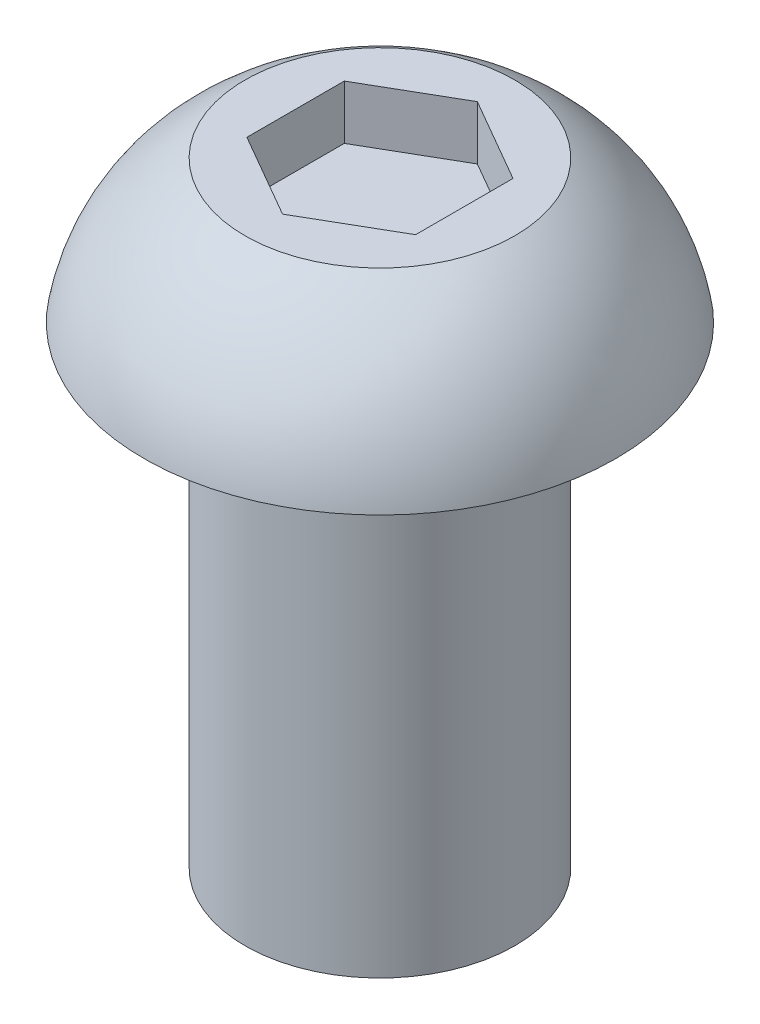
ISO-10303-21;
HEADER;
FILE_DESCRIPTION(('STEP AP214'),'2;1');
FILE_NAME('part.step','',(''),(''),'','','');
FILE_SCHEMA(('AUTOMOTIVE_DESIGN { 1 0 10303 214 1 1 1 1 }'));
ENDSEC;
DATA;
#1=APPLICATION_CONTEXT('core data for automotive mechanical design processes');
#2=APPLICATION_PROTOCOL_DEFINITION('international standard','automotive_design',2000,#1);
#3=PRODUCT_CONTEXT('',#1,'mechanical');
#4=PRODUCT('Part','Part','',(#3));
#5=PRODUCT_RELATED_PRODUCT_CATEGORY('part','',(#4));
#6=PRODUCT_DEFINITION_FORMATION('','',#4);
#7=PRODUCT_DEFINITION_CONTEXT('part definition',#1,'design');
#8=PRODUCT_DEFINITION('design','',#6,#7);
#9=PRODUCT_DEFINITION_SHAPE('','',#8);
#10=(LENGTH_UNIT() NAMED_UNIT(*) SI_UNIT(.MILLI.,.METRE.));
#11=(NAMED_UNIT(*) PLANE_ANGLE_UNIT() SI_UNIT($,.RADIAN.));
#12=(NAMED_UNIT(*) SI_UNIT($,.STERADIAN.) SOLID_ANGLE_UNIT());
#13=UNCERTAINTY_MEASURE_WITH_UNIT(LENGTH_MEASURE(1.E-05),#10,'distance_accuracy_value','');
#14=(GEOMETRIC_REPRESENTATION_CONTEXT(3) GLOBAL_UNCERTAINTY_ASSIGNED_CONTEXT((#13)) GLOBAL_UNIT_ASSIGNED_CONTEXT((#10,
#11,#12)) REPRESENTATION_CONTEXT('',''));
#15=CARTESIAN_POINT('',(0.,0.,0.));
#16=DIRECTION('',(0.,0.,1.));
#17=DIRECTION('',(1.,0.,0.));
#18=AXIS2_PLACEMENT_3D('',#15,#16,#17);
#19=CARTESIAN_POINT('',(0.,-11.1125,0.));
#20=DIRECTION('',(0.,-1.,0.));
#21=DIRECTION('',(1.,0.,0.));
#22=AXIS2_PLACEMENT_3D('',#19,#20,#21);
#23=CYLINDRICAL_SURFACE('',#22,3.175);
#24=CARTESIAN_POINT('',(0.,-11.1125,0.));
#25=DIRECTION('',(0.,-1.,0.));
#26=DIRECTION('',(1.,0.,0.));
#27=AXIS2_PLACEMENT_3D('',#24,#25,#26);
#28=CIRCLE('',#27,3.175);
#29=CARTESIAN_POINT('',(3.175,-11.1125,0.));
#30=VERTEX_POINT('',#29);
#31=EDGE_CURVE('E134',#30,#30,#28,.T.);
#32=ORIENTED_EDGE('',*,*,#31,.F.);
#33=EDGE_LOOP('',(#32));
#34=FACE_BOUND('',#33,.T.);
#35=CARTESIAN_POINT('',(0.,0.,0.));
#36=DIRECTION('',(0.,-1.,0.));
#37=DIRECTION('',(1.,0.,0.));
#38=AXIS2_PLACEMENT_3D('',#35,#36,#37);
#39=CIRCLE('',#38,3.175);
#40=CARTESIAN_POINT('',(3.175,0.,0.));
#41=VERTEX_POINT('',#40);
#42=EDGE_CURVE('E11',#41,#41,#39,.T.);
#43=ORIENTED_EDGE('',*,*,#42,.T.);
#44=EDGE_LOOP('',(#43));
#45=FACE_BOUND('',#44,.T.);
#46=ADVANCED_FACE('F33',(#34,#45),#23,.T.);
#47=CARTESIAN_POINT('',(-3.175,0.,0.));
#48=DIRECTION('',(0.,1.,0.));
#49=DIRECTION('',(-1.,0.,0.));
#50=AXIS2_PLACEMENT_3D('',#47,#48,#49);
#51=PLANE('',#50);
#52=ORIENTED_EDGE('',*,*,#42,.F.);
#53=EDGE_LOOP('',(#52));
#54=FACE_BOUND('',#53,.T.);
#55=CARTESIAN_POINT('',(0.,0.,0.));
#56=DIRECTION('',(0.,-1.,0.));
#57=DIRECTION('',(1.,0.,0.));
#58=AXIS2_PLACEMENT_3D('',#55,#56,#57);
#59=CIRCLE('',#58,5.5499);
#60=CARTESIAN_POINT('',(5.5499,0.,0.));
#61=VERTEX_POINT('',#60);
#62=EDGE_CURVE('E40',#61,#61,#59,.T.);
#63=ORIENTED_EDGE('',*,*,#62,.T.);
#64=EDGE_LOOP('',(#63));
#65=FACE_BOUND('',#64,.T.);
#66=ADVANCED_FACE('F147',(#54,#65),#51,.F.);
#67=CARTESIAN_POINT('',(0.,-0.775033603344355,0.));
#68=DIRECTION('',(0.,-1.,0.));
#69=DIRECTION('',(1.,0.,0.));
#70=AXIS2_PLACEMENT_3D('',#67,#68,#69);
#71=DEGENERATE_TOROIDAL_SURFACE('',#70,0.90160255998444,4.71246710091096,.T.);
#72=ORIENTED_EDGE('',*,*,#62,.F.);
#73=EDGE_LOOP('',(#72));
#74=FACE_BOUND('',#73,.T.);
#75=CARTESIAN_POINT('',(0.,3.3528,0.));
#76=DIRECTION('',(0.,-1.,0.));
#77=DIRECTION('',(1.,0.,0.));
#78=AXIS2_PLACEMENT_3D('',#75,#76,#77);
#79=CIRCLE('',#78,3.175);
#80=CARTESIAN_POINT('',(3.175,3.3528,0.));
#81=VERTEX_POINT('',#80);
#82=EDGE_CURVE('E142',#81,#81,#79,.T.);
#83=ORIENTED_EDGE('',*,*,#82,.T.);
#84=EDGE_LOOP('',(#83));
#85=FACE_BOUND('',#84,.T.);
#86=ADVANCED_FACE('F149',(#74,#85),#71,.T.);
#87=CARTESIAN_POINT('',(0.,3.3528,0.));
#88=DIRECTION('',(0.,-1.,0.));
#89=DIRECTION('',(1.,0.,0.));
#90=AXIS2_PLACEMENT_3D('',#87,#88,#89);
#91=PLANE('',#90);
#92=DIRECTION('',(0.,0.,1.));
#93=VECTOR('',#92,1.);
#94=CARTESIAN_POINT('',(-1.984375,3.3528,-1.14567944042316));
#95=LINE('',#94,#93);
#96=CARTESIAN_POINT('',(-1.984375,3.3528,-1.14567944042316));
#97=VERTEX_POINT('',#96);
#98=CARTESIAN_POINT('',(-1.984375,3.3528,1.14567944042316));
#99=VERTEX_POINT('',#98);
#100=EDGE_CURVE('E121',#97,#99,#95,.T.);
#101=ORIENTED_EDGE('',*,*,#100,.F.);
#102=DIRECTION('',(-0.866025403784439,0.,0.5));
#103=VECTOR('',#102,1.);
#104=CARTESIAN_POINT('',(0.,3.3528,-2.29135888084633));
#105=LINE('',#104,#103);
#106=CARTESIAN_POINT('',(0.,3.3528,-2.29135888084633));
#107=VERTEX_POINT('',#106);
#108=EDGE_CURVE('E47',#107,#97,#105,.T.);
#109=ORIENTED_EDGE('',*,*,#108,.F.);
#110=DIRECTION('',(-0.866025403784438,0.,-0.5));
#111=VECTOR('',#110,1.);
#112=CARTESIAN_POINT('',(1.984375,3.3528,-1.14567944042316));
#113=LINE('',#112,#111);
#114=CARTESIAN_POINT('',(1.984375,3.3528,-1.14567944042316));
#115=VERTEX_POINT('',#114);
#116=EDGE_CURVE('E130',#115,#107,#113,.T.);
#117=ORIENTED_EDGE('',*,*,#116,.F.);
#118=DIRECTION('',(0.,0.,-1.));
#119=VECTOR('',#118,1.);
#120=CARTESIAN_POINT('',(1.984375,3.3528,1.14567944042316));
#121=LINE('',#120,#119);
#122=CARTESIAN_POINT('',(1.984375,3.3528,1.14567944042316));
#123=VERTEX_POINT('',#122);
#124=EDGE_CURVE('E128',#123,#115,#121,.T.);
#125=ORIENTED_EDGE('',*,*,#124,.F.);
#126=DIRECTION('',(0.866025403784439,0.,-0.5));
#127=VECTOR('',#126,1.);
#128=CARTESIAN_POINT('',(0.,3.3528,2.29135888084633));
#129=LINE('',#128,#127);
#130=CARTESIAN_POINT('',(0.,3.3528,2.29135888084633));
#131=VERTEX_POINT('',#130);
#132=EDGE_CURVE('E95',#131,#123,#129,.T.);
#133=ORIENTED_EDGE('',*,*,#132,.F.);
#134=DIRECTION('',(0.866025403784439,0.,0.5));
#135=VECTOR('',#134,1.);
#136=CARTESIAN_POINT('',(-1.984375,3.3528,1.14567944042316));
#137=LINE('',#136,#135);
#138=EDGE_CURVE('E124',#99,#131,#137,.T.);
#139=ORIENTED_EDGE('',*,*,#138,.F.);
#140=EDGE_LOOP('',(#101,#109,#117,#125,#133,#139));
#141=FACE_BOUND('',#140,.T.);
#142=ORIENTED_EDGE('',*,*,#82,.F.);
#143=EDGE_LOOP('',(#142));
#144=FACE_BOUND('',#143,.T.);
#145=ADVANCED_FACE('F152',(#141,#144),#91,.F.);
#146=CARTESIAN_POINT('',(-3.175,-11.1125,0.));
#147=DIRECTION('',(0.,1.,0.));
#148=DIRECTION('',(-1.,0.,0.));
#149=AXIS2_PLACEMENT_3D('',#146,#147,#148);
#150=PLANE('',#149);
#151=ORIENTED_EDGE('',*,*,#31,.T.);
#152=EDGE_LOOP('',(#151));
#153=FACE_BOUND('',#152,.T.);
#154=ADVANCED_FACE('F157',(#153),#150,.F.);
#155=CARTESIAN_POINT('',(0.,2.0828,-2.29135888084633));
#156=DIRECTION('',(-0.5,0.,-0.866025403784438));
#157=DIRECTION('',(-0.866025403784439,0.,0.5));
#158=AXIS2_PLACEMENT_3D('',#155,#156,#157);
#159=PLANE('',#158);
#160=ORIENTED_EDGE('',*,*,#108,.T.);
#161=DIRECTION('',(0.,1.,0.));
#162=VECTOR('',#161,1.);
#163=CARTESIAN_POINT('',(-1.984375,2.0828,-1.14567944042316));
#164=LINE('',#163,#162);
#165=CARTESIAN_POINT('',(-1.984375,2.0828,-1.14567944042316));
#166=VERTEX_POINT('',#165);
#167=EDGE_CURVE('E77',#166,#97,#164,.T.);
#168=ORIENTED_EDGE('',*,*,#167,.F.);
#169=DIRECTION('',(-0.866025403784439,0.,0.5));
#170=VECTOR('',#169,1.);
#171=CARTESIAN_POINT('',(0.,2.0828,-2.29135888084633));
#172=LINE('',#171,#170);
#173=CARTESIAN_POINT('',(0.,2.0828,-2.29135888084633));
#174=VERTEX_POINT('',#173);
#175=EDGE_CURVE('E132',#174,#166,#172,.T.);
#176=ORIENTED_EDGE('',*,*,#175,.F.);
#177=DIRECTION('',(0.,1.,0.));
#178=VECTOR('',#177,1.);
#179=CARTESIAN_POINT('',(0.,2.0828,-2.29135888084633));
#180=LINE('',#179,#178);
#181=EDGE_CURVE('E55',#174,#107,#180,.T.);
#182=ORIENTED_EDGE('',*,*,#181,.T.);
#183=EDGE_LOOP('',(#160,#168,#176,#182));
#184=FACE_BOUND('',#183,.T.);
#185=ADVANCED_FACE('F163',(#184),#159,.F.);
#186=CARTESIAN_POINT('',(1.984375,2.0828,-1.14567944042316));
#187=DIRECTION('',(0.5,0.,-0.866025403784439));
#188=DIRECTION('',(-0.866025403784438,0.,-0.5));
#189=AXIS2_PLACEMENT_3D('',#186,#187,#188);
#190=PLANE('',#189);
#191=ORIENTED_EDGE('',*,*,#116,.T.);
#192=ORIENTED_EDGE('',*,*,#181,.F.);
#193=DIRECTION('',(-0.866025403784438,0.,-0.5));
#194=VECTOR('',#193,1.);
#195=CARTESIAN_POINT('',(1.984375,2.0828,-1.14567944042316));
#196=LINE('',#195,#194);
#197=CARTESIAN_POINT('',(1.984375,2.0828,-1.14567944042316));
#198=VERTEX_POINT('',#197);
#199=EDGE_CURVE('E107',#198,#174,#196,.T.);
#200=ORIENTED_EDGE('',*,*,#199,.F.);
#201=DIRECTION('',(0.,1.,0.));
#202=VECTOR('',#201,1.);
#203=CARTESIAN_POINT('',(1.984375,2.0828,-1.14567944042316));
#204=LINE('',#203,#202);
#205=EDGE_CURVE('E99',#198,#115,#204,.T.);
#206=ORIENTED_EDGE('',*,*,#205,.T.);
#207=EDGE_LOOP('',(#191,#192,#200,#206));
#208=FACE_BOUND('',#207,.T.);
#209=ADVANCED_FACE('F201',(#208),#190,.F.);
#210=CARTESIAN_POINT('',(1.984375,2.0828,1.14567944042316));
#211=DIRECTION('',(1.,0.,0.));
#212=DIRECTION('',(0.,0.,-1.));
#213=AXIS2_PLACEMENT_3D('',#210,#211,#212);
#214=PLANE('',#213);
#215=ORIENTED_EDGE('',*,*,#124,.T.);
#216=ORIENTED_EDGE('',*,*,#205,.F.);
#217=DIRECTION('',(0.,0.,-1.));
#218=VECTOR('',#217,1.);
#219=CARTESIAN_POINT('',(1.984375,2.0828,1.14567944042316));
#220=LINE('',#219,#218);
#221=CARTESIAN_POINT('',(1.984375,2.0828,1.14567944042316));
#222=VERTEX_POINT('',#221);
#223=EDGE_CURVE('E103',#222,#198,#220,.T.);
#224=ORIENTED_EDGE('',*,*,#223,.F.);
#225=DIRECTION('',(0.,1.,0.));
#226=VECTOR('',#225,1.);
#227=CARTESIAN_POINT('',(1.984375,2.0828,1.14567944042316));
#228=LINE('',#227,#226);
#229=EDGE_CURVE('E88',#222,#123,#228,.T.);
#230=ORIENTED_EDGE('',*,*,#229,.T.);
#231=EDGE_LOOP('',(#215,#216,#224,#230));
#232=FACE_BOUND('',#231,.T.);
#233=ADVANCED_FACE('F104',(#232),#214,.F.);
#234=CARTESIAN_POINT('',(0.,2.0828,2.29135888084633));
#235=DIRECTION('',(0.5,0.,0.866025403784438));
#236=DIRECTION('',(0.866025403784439,0.,-0.5));
#237=AXIS2_PLACEMENT_3D('',#234,#235,#236);
#238=PLANE('',#237);
#239=ORIENTED_EDGE('',*,*,#132,.T.);
#240=ORIENTED_EDGE('',*,*,#229,.F.);
#241=DIRECTION('',(0.866025403784439,0.,-0.5));
#242=VECTOR('',#241,1.);
#243=CARTESIAN_POINT('',(0.,2.0828,2.29135888084633));
#244=LINE('',#243,#242);
#245=CARTESIAN_POINT('',(0.,2.0828,2.29135888084633));
#246=VERTEX_POINT('',#245);
#247=EDGE_CURVE('E92',#246,#222,#244,.T.);
#248=ORIENTED_EDGE('',*,*,#247,.F.);
#249=DIRECTION('',(0.,1.,0.));
#250=VECTOR('',#249,1.);
#251=CARTESIAN_POINT('',(0.,2.0828,2.29135888084633));
#252=LINE('',#251,#250);
#253=EDGE_CURVE('E100',#246,#131,#252,.T.);
#254=ORIENTED_EDGE('',*,*,#253,.T.);
#255=EDGE_LOOP('',(#239,#240,#248,#254));
#256=FACE_BOUND('',#255,.T.);
#257=ADVANCED_FACE('F90',(#256),#238,.F.);
#258=CARTESIAN_POINT('',(-1.984375,2.0828,1.14567944042316));
#259=DIRECTION('',(-0.5,0.,0.866025403784439));
#260=DIRECTION('',(0.866025403784439,0.,0.5));
#261=AXIS2_PLACEMENT_3D('',#258,#259,#260);
#262=PLANE('',#261);
#263=ORIENTED_EDGE('',*,*,#138,.T.);
#264=ORIENTED_EDGE('',*,*,#253,.F.);
#265=DIRECTION('',(0.866025403784439,0.,0.5));
#266=VECTOR('',#265,1.);
#267=CARTESIAN_POINT('',(-1.984375,2.0828,1.14567944042316));
#268=LINE('',#267,#266);
#269=CARTESIAN_POINT('',(-1.984375,2.0828,1.14567944042316));
#270=VERTEX_POINT('',#269);
#271=EDGE_CURVE('E113',#270,#246,#268,.T.);
#272=ORIENTED_EDGE('',*,*,#271,.F.);
#273=DIRECTION('',(0.,1.,0.));
#274=VECTOR('',#273,1.);
#275=CARTESIAN_POINT('',(-1.984375,2.0828,1.14567944042316));
#276=LINE('',#275,#274);
#277=EDGE_CURVE('E137',#270,#99,#276,.T.);
#278=ORIENTED_EDGE('',*,*,#277,.T.);
#279=EDGE_LOOP('',(#263,#264,#272,#278));
#280=FACE_BOUND('',#279,.T.);
#281=ADVANCED_FACE('F226',(#280),#262,.F.);
#282=CARTESIAN_POINT('',(-1.984375,2.0828,-1.14567944042316));
#283=DIRECTION('',(-1.,0.,0.));
#284=DIRECTION('',(0.,0.,1.));
#285=AXIS2_PLACEMENT_3D('',#282,#283,#284);
#286=PLANE('',#285);
#287=ORIENTED_EDGE('',*,*,#100,.T.);
#288=ORIENTED_EDGE('',*,*,#277,.F.);
#289=DIRECTION('',(0.,0.,1.));
#290=VECTOR('',#289,1.);
#291=CARTESIAN_POINT('',(-1.984375,2.0828,-1.14567944042316));
#292=LINE('',#291,#290);
#293=EDGE_CURVE('E115',#166,#270,#292,.T.);
#294=ORIENTED_EDGE('',*,*,#293,.F.);
#295=ORIENTED_EDGE('',*,*,#167,.T.);
#296=EDGE_LOOP('',(#287,#288,#294,#295));
#297=FACE_BOUND('',#296,.T.);
#298=ADVANCED_FACE('F235',(#297),#286,.F.);
#299=CARTESIAN_POINT('',(0.,2.0828,0.));
#300=DIRECTION('',(0.,1.,0.));
#301=DIRECTION('',(0.,0.,1.));
#302=AXIS2_PLACEMENT_3D('',#299,#300,#301);
#303=PLANE('',#302);
#304=ORIENTED_EDGE('',*,*,#175,.T.);
#305=ORIENTED_EDGE('',*,*,#293,.T.);
#306=ORIENTED_EDGE('',*,*,#271,.T.);
#307=ORIENTED_EDGE('',*,*,#247,.T.);
#308=ORIENTED_EDGE('',*,*,#223,.T.);
#309=ORIENTED_EDGE('',*,*,#199,.T.);
#310=EDGE_LOOP('',(#304,#305,#306,#307,#308,#309));
#311=FACE_BOUND('',#310,.T.);
#312=ADVANCED_FACE('F110',(#311),#303,.T.);
#313=CLOSED_SHELL('',(#46,#66,#86,#145,#154,#185,#209,#233,#257,#281,#298,#312));
#314=MANIFOLD_SOLID_BREP('B2',#313);
#315=ADVANCED_BREP_SHAPE_REPRESENTATION('',(#18,#314),#14);
#316=SHAPE_DEFINITION_REPRESENTATION(#9,#315);
ENDSEC;
END-ISO-10303-21;
